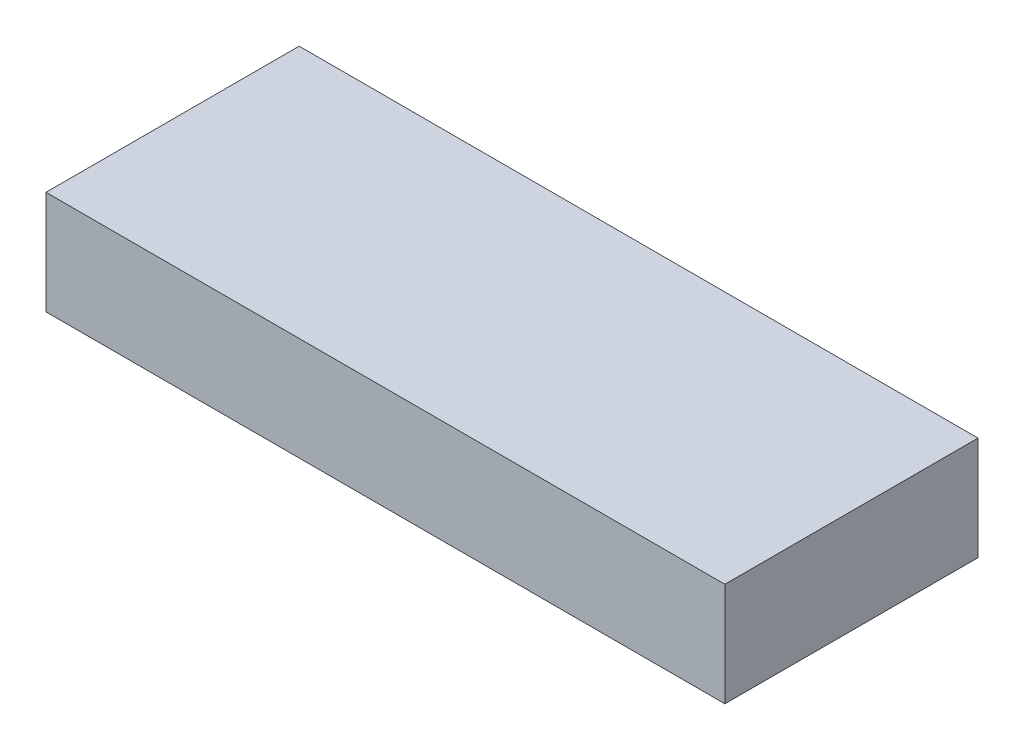
ISO-10303-21;
HEADER;
FILE_DESCRIPTION(('STEP AP214'),'2;1');
FILE_NAME('part.step','',(''),(''),'','','');
FILE_SCHEMA(('AUTOMOTIVE_DESIGN { 1 0 10303 214 1 1 1 1 }'));
ENDSEC;
DATA;
#1=APPLICATION_CONTEXT('core data for automotive mechanical design processes');
#2=APPLICATION_PROTOCOL_DEFINITION('international standard','automotive_design',2000,#1);
#3=PRODUCT_CONTEXT('',#1,'mechanical');
#4=PRODUCT('Part','Part','',(#3));
#5=PRODUCT_RELATED_PRODUCT_CATEGORY('part','',(#4));
#6=PRODUCT_DEFINITION_FORMATION('','',#4);
#7=PRODUCT_DEFINITION_CONTEXT('part definition',#1,'design');
#8=PRODUCT_DEFINITION('design','',#6,#7);
#9=PRODUCT_DEFINITION_SHAPE('','',#8);
#10=(LENGTH_UNIT() NAMED_UNIT(*) SI_UNIT(.MILLI.,.METRE.));
#11=(NAMED_UNIT(*) PLANE_ANGLE_UNIT() SI_UNIT($,.RADIAN.));
#12=(NAMED_UNIT(*) SI_UNIT($,.STERADIAN.) SOLID_ANGLE_UNIT());
#13=UNCERTAINTY_MEASURE_WITH_UNIT(LENGTH_MEASURE(1.E-05),#10,'distance_accuracy_value','');
#14=(GEOMETRIC_REPRESENTATION_CONTEXT(3) GLOBAL_UNCERTAINTY_ASSIGNED_CONTEXT((#13)) GLOBAL_UNIT_ASSIGNED_CONTEXT((#10,
#11,#12)) REPRESENTATION_CONTEXT('',''));
#15=CARTESIAN_POINT('',(0.,0.,0.));
#16=DIRECTION('',(0.,0.,1.));
#17=DIRECTION('',(1.,0.,0.));
#18=AXIS2_PLACEMENT_3D('',#15,#16,#17);
#19=CARTESIAN_POINT('',(-59.,9.,22.));
#20=DIRECTION('',(1.,0.,0.));
#21=DIRECTION('',(0.,0.,-1.));
#22=AXIS2_PLACEMENT_3D('',#19,#20,#21);
#23=PLANE('',#22);
#24=DIRECTION('',(0.,0.,1.));
#25=VECTOR('',#24,1.);
#26=CARTESIAN_POINT('',(-59.,-9.,22.));
#27=LINE('',#26,#25);
#28=CARTESIAN_POINT('',(-59.,-9.,-22.));
#29=VERTEX_POINT('',#28);
#30=CARTESIAN_POINT('',(-59.,-9.,22.));
#31=VERTEX_POINT('',#30);
#32=EDGE_CURVE('E93',#29,#31,#27,.T.);
#33=ORIENTED_EDGE('',*,*,#32,.T.);
#34=DIRECTION('',(0.,-1.,0.));
#35=VECTOR('',#34,1.);
#36=CARTESIAN_POINT('',(-59.,9.,22.));
#37=LINE('',#36,#35);
#38=CARTESIAN_POINT('',(-59.,9.,22.));
#39=VERTEX_POINT('',#38);
#40=EDGE_CURVE('E11',#39,#31,#37,.T.);
#41=ORIENTED_EDGE('',*,*,#40,.F.);
#42=DIRECTION('',(0.,0.,1.));
#43=VECTOR('',#42,1.);
#44=CARTESIAN_POINT('',(-59.,9.,22.));
#45=LINE('',#44,#43);
#46=CARTESIAN_POINT('',(-59.,9.,-22.));
#47=VERTEX_POINT('',#46);
#48=EDGE_CURVE('E81',#47,#39,#45,.T.);
#49=ORIENTED_EDGE('',*,*,#48,.F.);
#50=DIRECTION('',(0.,-1.,0.));
#51=VECTOR('',#50,1.);
#52=CARTESIAN_POINT('',(-59.,9.,-22.));
#53=LINE('',#52,#51);
#54=EDGE_CURVE('E89',#47,#29,#53,.T.);
#55=ORIENTED_EDGE('',*,*,#54,.T.);
#56=EDGE_LOOP('',(#33,#41,#49,#55));
#57=FACE_BOUND('',#56,.T.);
#58=ADVANCED_FACE('F30',(#57),#23,.F.);
#59=CARTESIAN_POINT('',(59.,9.,22.));
#60=DIRECTION('',(0.,0.,-1.));
#61=DIRECTION('',(-1.,0.,0.));
#62=AXIS2_PLACEMENT_3D('',#59,#60,#61);
#63=PLANE('',#62);
#64=DIRECTION('',(1.,0.,0.));
#65=VECTOR('',#64,1.);
#66=CARTESIAN_POINT('',(59.,-9.,22.));
#67=LINE('',#66,#65);
#68=CARTESIAN_POINT('',(59.,-9.,22.));
#69=VERTEX_POINT('',#68);
#70=EDGE_CURVE('E85',#31,#69,#67,.T.);
#71=ORIENTED_EDGE('',*,*,#70,.T.);
#72=DIRECTION('',(0.,-1.,0.));
#73=VECTOR('',#72,1.);
#74=CARTESIAN_POINT('',(59.,9.,22.));
#75=LINE('',#74,#73);
#76=CARTESIAN_POINT('',(59.,9.,22.));
#77=VERTEX_POINT('',#76);
#78=EDGE_CURVE('E38',#77,#69,#75,.T.);
#79=ORIENTED_EDGE('',*,*,#78,.F.);
#80=DIRECTION('',(1.,0.,0.));
#81=VECTOR('',#80,1.);
#82=CARTESIAN_POINT('',(59.,9.,22.));
#83=LINE('',#82,#81);
#84=EDGE_CURVE('E76',#39,#77,#83,.T.);
#85=ORIENTED_EDGE('',*,*,#84,.F.);
#86=ORIENTED_EDGE('',*,*,#40,.T.);
#87=EDGE_LOOP('',(#71,#79,#85,#86));
#88=FACE_BOUND('',#87,.T.);
#89=ADVANCED_FACE('F84',(#88),#63,.F.);
#90=CARTESIAN_POINT('',(59.,9.,22.));
#91=DIRECTION('',(-1.,0.,0.));
#92=DIRECTION('',(0.,0.,1.));
#93=AXIS2_PLACEMENT_3D('',#90,#91,#92);
#94=PLANE('',#93);
#95=DIRECTION('',(0.,0.,-1.));
#96=VECTOR('',#95,1.);
#97=CARTESIAN_POINT('',(59.,-9.,22.));
#98=LINE('',#97,#96);
#99=CARTESIAN_POINT('',(59.,-9.,-22.));
#100=VERTEX_POINT('',#99);
#101=EDGE_CURVE('E63',#69,#100,#98,.T.);
#102=ORIENTED_EDGE('',*,*,#101,.T.);
#103=DIRECTION('',(0.,-1.,0.));
#104=VECTOR('',#103,1.);
#105=CARTESIAN_POINT('',(59.,9.,-22.));
#106=LINE('',#105,#104);
#107=CARTESIAN_POINT('',(59.,9.,-22.));
#108=VERTEX_POINT('',#107);
#109=EDGE_CURVE('E86',#108,#100,#106,.T.);
#110=ORIENTED_EDGE('',*,*,#109,.F.);
#111=DIRECTION('',(0.,0.,-1.));
#112=VECTOR('',#111,1.);
#113=CARTESIAN_POINT('',(59.,9.,22.));
#114=LINE('',#113,#112);
#115=EDGE_CURVE('E79',#77,#108,#114,.T.);
#116=ORIENTED_EDGE('',*,*,#115,.F.);
#117=ORIENTED_EDGE('',*,*,#78,.T.);
#118=EDGE_LOOP('',(#102,#110,#116,#117));
#119=FACE_BOUND('',#118,.T.);
#120=ADVANCED_FACE('F87',(#119),#94,.F.);
#121=CARTESIAN_POINT('',(59.,9.,-22.));
#122=DIRECTION('',(0.,0.,1.));
#123=DIRECTION('',(1.,0.,0.));
#124=AXIS2_PLACEMENT_3D('',#121,#122,#123);
#125=PLANE('',#124);
#126=DIRECTION('',(-1.,0.,0.));
#127=VECTOR('',#126,1.);
#128=CARTESIAN_POINT('',(59.,-9.,-22.));
#129=LINE('',#128,#127);
#130=EDGE_CURVE('E69',#100,#29,#129,.T.);
#131=ORIENTED_EDGE('',*,*,#130,.T.);
#132=ORIENTED_EDGE('',*,*,#54,.F.);
#133=DIRECTION('',(-1.,0.,0.));
#134=VECTOR('',#133,1.);
#135=CARTESIAN_POINT('',(59.,9.,-22.));
#136=LINE('',#135,#134);
#137=EDGE_CURVE('E46',#108,#47,#136,.T.);
#138=ORIENTED_EDGE('',*,*,#137,.F.);
#139=ORIENTED_EDGE('',*,*,#109,.T.);
#140=EDGE_LOOP('',(#131,#132,#138,#139));
#141=FACE_BOUND('',#140,.T.);
#142=ADVANCED_FACE('F100',(#141),#125,.F.);
#143=CARTESIAN_POINT('',(-59.,9.,-22.));
#144=DIRECTION('',(0.,1.,0.));
#145=DIRECTION('',(0.,0.,1.));
#146=AXIS2_PLACEMENT_3D('',#143,#144,#145);
#147=PLANE('',#146);
#148=ORIENTED_EDGE('',*,*,#48,.T.);
#149=ORIENTED_EDGE('',*,*,#84,.T.);
#150=ORIENTED_EDGE('',*,*,#115,.T.);
#151=ORIENTED_EDGE('',*,*,#137,.T.);
#152=EDGE_LOOP('',(#148,#149,#150,#151));
#153=FACE_BOUND('',#152,.T.);
#154=ADVANCED_FACE('F77',(#153),#147,.T.);
#155=CARTESIAN_POINT('',(-59.,-9.,-22.));
#156=DIRECTION('',(0.,1.,0.));
#157=DIRECTION('',(0.,0.,1.));
#158=AXIS2_PLACEMENT_3D('',#155,#156,#157);
#159=PLANE('',#158);
#160=ORIENTED_EDGE('',*,*,#32,.F.);
#161=ORIENTED_EDGE('',*,*,#130,.F.);
#162=ORIENTED_EDGE('',*,*,#101,.F.);
#163=ORIENTED_EDGE('',*,*,#70,.F.);
#164=EDGE_LOOP('',(#160,#161,#162,#163));
#165=FACE_BOUND('',#164,.T.);
#166=ADVANCED_FACE('F103',(#165),#159,.F.);
#167=CLOSED_SHELL('',(#58,#89,#120,#142,#154,#166));
#168=MANIFOLD_SOLID_BREP('B2',#167);
#169=ADVANCED_BREP_SHAPE_REPRESENTATION('',(#18,#168),#14);
#170=SHAPE_DEFINITION_REPRESENTATION(#9,#169);
ENDSEC;
END-ISO-10303-21;
